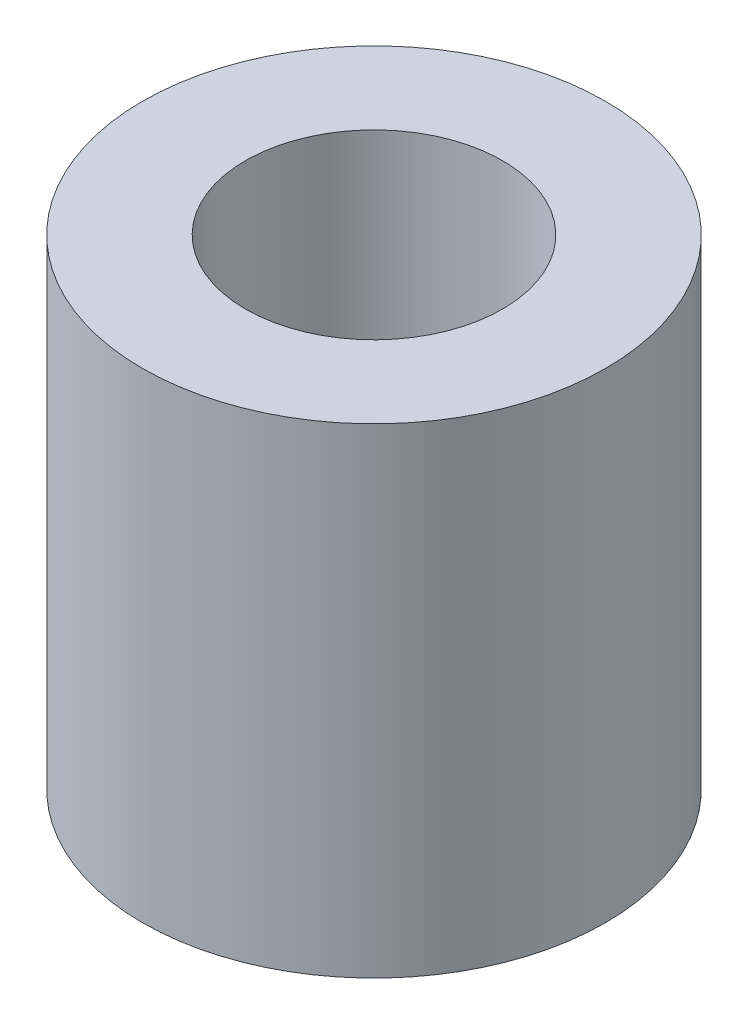
ISO-10303-21;
HEADER;
FILE_DESCRIPTION(('STEP AP214'),'2;1');
FILE_NAME('part.step','',(''),(''),'','','');
FILE_SCHEMA(('AUTOMOTIVE_DESIGN { 1 0 10303 214 1 1 1 1 }'));
ENDSEC;
DATA;
#1=APPLICATION_CONTEXT('core data for automotive mechanical design processes');
#2=APPLICATION_PROTOCOL_DEFINITION('international standard','automotive_design',2000,#1);
#3=PRODUCT_CONTEXT('',#1,'mechanical');
#4=PRODUCT('Part','Part','',(#3));
#5=PRODUCT_RELATED_PRODUCT_CATEGORY('part','',(#4));
#6=PRODUCT_DEFINITION_FORMATION('','',#4);
#7=PRODUCT_DEFINITION_CONTEXT('part definition',#1,'design');
#8=PRODUCT_DEFINITION('design','',#6,#7);
#9=PRODUCT_DEFINITION_SHAPE('','',#8);
#10=(LENGTH_UNIT() NAMED_UNIT(*) SI_UNIT(.MILLI.,.METRE.));
#11=(NAMED_UNIT(*) PLANE_ANGLE_UNIT() SI_UNIT($,.RADIAN.));
#12=(NAMED_UNIT(*) SI_UNIT($,.STERADIAN.) SOLID_ANGLE_UNIT());
#13=UNCERTAINTY_MEASURE_WITH_UNIT(LENGTH_MEASURE(1.E-05),#10,'distance_accuracy_value','');
#14=(GEOMETRIC_REPRESENTATION_CONTEXT(3) GLOBAL_UNCERTAINTY_ASSIGNED_CONTEXT((#13)) GLOBAL_UNIT_ASSIGNED_CONTEXT((#10,
#11,#12)) REPRESENTATION_CONTEXT('',''));
#15=CARTESIAN_POINT('',(0.,0.,0.));
#16=DIRECTION('',(0.,0.,1.));
#17=DIRECTION('',(1.,0.,0.));
#18=AXIS2_PLACEMENT_3D('',#15,#16,#17);
#19=CARTESIAN_POINT('',(0.,7.,0.));
#20=DIRECTION('',(0.,1.,0.));
#21=DIRECTION('',(0.,0.,1.));
#22=AXIS2_PLACEMENT_3D('',#19,#20,#21);
#23=PLANE('',#22);
#24=CARTESIAN_POINT('',(0.,7.,0.));
#25=DIRECTION('',(0.,1.,0.));
#26=DIRECTION('',(0.,0.,1.));
#27=AXIS2_PLACEMENT_3D('',#24,#25,#26);
#28=CIRCLE('',#27,3.375);
#29=CARTESIAN_POINT('',(0.,7.,3.375));
#30=VERTEX_POINT('',#29);
#31=EDGE_CURVE('E10',#30,#30,#28,.T.);
#32=ORIENTED_EDGE('',*,*,#31,.T.);
#33=EDGE_LOOP('',(#32));
#34=FACE_BOUND('',#33,.T.);
#35=CARTESIAN_POINT('',(0.,7.,0.));
#36=DIRECTION('',(0.,1.,0.));
#37=DIRECTION('',(0.,0.,1.));
#38=AXIS2_PLACEMENT_3D('',#35,#36,#37);
#39=CIRCLE('',#38,1.875);
#40=CARTESIAN_POINT('',(0.,7.,1.875));
#41=VERTEX_POINT('',#40);
#42=EDGE_CURVE('E46',#41,#41,#39,.T.);
#43=ORIENTED_EDGE('',*,*,#42,.F.);
#44=EDGE_LOOP('',(#43));
#45=FACE_BOUND('',#44,.T.);
#46=ADVANCED_FACE('F35',(#34,#45),#23,.T.);
#47=CARTESIAN_POINT('',(0.,0.,0.));
#48=DIRECTION('',(0.,1.,0.));
#49=DIRECTION('',(0.,0.,1.));
#50=AXIS2_PLACEMENT_3D('',#47,#48,#49);
#51=PLANE('',#50);
#52=CARTESIAN_POINT('',(0.,0.,0.));
#53=DIRECTION('',(0.,1.,0.));
#54=DIRECTION('',(0.,0.,1.));
#55=AXIS2_PLACEMENT_3D('',#52,#53,#54);
#56=CIRCLE('',#55,3.375);
#57=CARTESIAN_POINT('',(0.,0.,3.375));
#58=VERTEX_POINT('',#57);
#59=EDGE_CURVE('E39',#58,#58,#56,.T.);
#60=ORIENTED_EDGE('',*,*,#59,.F.);
#61=EDGE_LOOP('',(#60));
#62=FACE_BOUND('',#61,.T.);
#63=CARTESIAN_POINT('',(0.,0.,0.));
#64=DIRECTION('',(0.,1.,0.));
#65=DIRECTION('',(0.,0.,1.));
#66=AXIS2_PLACEMENT_3D('',#63,#64,#65);
#67=CIRCLE('',#66,1.875);
#68=CARTESIAN_POINT('',(0.,0.,1.875));
#69=VERTEX_POINT('',#68);
#70=EDGE_CURVE('E48',#69,#69,#67,.T.);
#71=ORIENTED_EDGE('',*,*,#70,.T.);
#72=EDGE_LOOP('',(#71));
#73=FACE_BOUND('',#72,.T.);
#74=ADVANCED_FACE('F58',(#62,#73),#51,.F.);
#75=CARTESIAN_POINT('',(0.,7.,0.));
#76=DIRECTION('',(0.,-1.,0.));
#77=DIRECTION('',(0.,0.,-1.));
#78=AXIS2_PLACEMENT_3D('',#75,#76,#77);
#79=CYLINDRICAL_SURFACE('',#78,3.375);
#80=ORIENTED_EDGE('',*,*,#31,.F.);
#81=EDGE_LOOP('',(#80));
#82=FACE_BOUND('',#81,.T.);
#83=ORIENTED_EDGE('',*,*,#59,.T.);
#84=EDGE_LOOP('',(#83));
#85=FACE_BOUND('',#84,.T.);
#86=ADVANCED_FACE('F37',(#82,#85),#79,.T.);
#87=CARTESIAN_POINT('',(0.,7.,0.));
#88=DIRECTION('',(0.,-1.,0.));
#89=DIRECTION('',(0.,0.,-1.));
#90=AXIS2_PLACEMENT_3D('',#87,#88,#89);
#91=CYLINDRICAL_SURFACE('',#90,1.875);
#92=ORIENTED_EDGE('',*,*,#42,.T.);
#93=EDGE_LOOP('',(#92));
#94=FACE_BOUND('',#93,.T.);
#95=ORIENTED_EDGE('',*,*,#70,.F.);
#96=EDGE_LOOP('',(#95));
#97=FACE_BOUND('',#96,.T.);
#98=ADVANCED_FACE('F54',(#94,#97),#91,.F.);
#99=CLOSED_SHELL('',(#46,#74,#86,#98));
#100=MANIFOLD_SOLID_BREP('B2',#99);
#101=ADVANCED_BREP_SHAPE_REPRESENTATION('',(#18,#100),#14);
#102=SHAPE_DEFINITION_REPRESENTATION(#9,#101);
ENDSEC;
END-ISO-10303-21;
